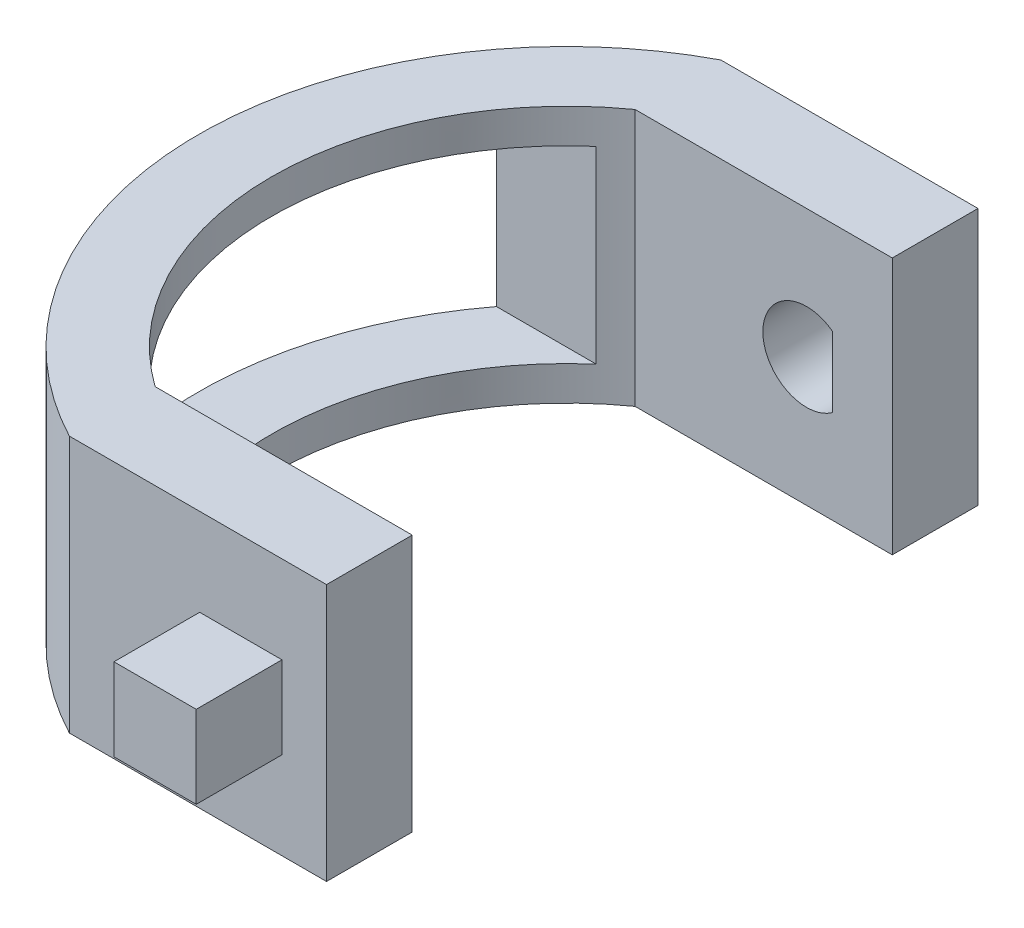
ISO-10303-21;
HEADER;
FILE_DESCRIPTION(('STEP AP214'),'2;1');
FILE_NAME('part.step','',(''),(''),'','','');
FILE_SCHEMA(('AUTOMOTIVE_DESIGN { 1 0 10303 214 1 1 1 1 }'));
ENDSEC;
DATA;
#1=APPLICATION_CONTEXT('core data for automotive mechanical design processes');
#2=APPLICATION_PROTOCOL_DEFINITION('international standard','automotive_design',2000,#1);
#3=PRODUCT_CONTEXT('',#1,'mechanical');
#4=PRODUCT('Part','Part','',(#3));
#5=PRODUCT_RELATED_PRODUCT_CATEGORY('part','',(#4));
#6=PRODUCT_DEFINITION_FORMATION('','',#4);
#7=PRODUCT_DEFINITION_CONTEXT('part definition',#1,'design');
#8=PRODUCT_DEFINITION('design','',#6,#7);
#9=PRODUCT_DEFINITION_SHAPE('','',#8);
#10=(LENGTH_UNIT() NAMED_UNIT(*) SI_UNIT(.MILLI.,.METRE.));
#11=(NAMED_UNIT(*) PLANE_ANGLE_UNIT() SI_UNIT($,.RADIAN.));
#12=(NAMED_UNIT(*) SI_UNIT($,.STERADIAN.) SOLID_ANGLE_UNIT());
#13=UNCERTAINTY_MEASURE_WITH_UNIT(LENGTH_MEASURE(1.E-05),#10,'distance_accuracy_value','');
#14=(GEOMETRIC_REPRESENTATION_CONTEXT(3) GLOBAL_UNCERTAINTY_ASSIGNED_CONTEXT((#13)) GLOBAL_UNIT_ASSIGNED_CONTEXT((#10,
#11,#12)) REPRESENTATION_CONTEXT('',''));
#15=CARTESIAN_POINT('',(0.,0.,0.));
#16=DIRECTION('',(0.,0.,1.));
#17=DIRECTION('',(1.,0.,0.));
#18=AXIS2_PLACEMENT_3D('',#15,#16,#17);
#19=CARTESIAN_POINT('',(2.4,-9.9,-19.));
#20=DIRECTION('',(0.,1.,0.));
#21=DIRECTION('',(0.,0.,1.));
#22=AXIS2_PLACEMENT_3D('',#19,#20,#21);
#23=CYLINDRICAL_SURFACE('',#22,21.4709105535839);
#24=CARTESIAN_POINT('',(2.4,5.1,-19.));
#25=DIRECTION('',(0.,-1.,0.));
#26=DIRECTION('',(0.,0.,-1.));
#27=AXIS2_PLACEMENT_3D('',#24,#25,#26);
#28=CIRCLE('',#27,21.4709105535839);
#29=CARTESIAN_POINT('',(-7.59999999999999,5.1,0.));
#30=VERTEX_POINT('',#29);
#31=CARTESIAN_POINT('',(-7.6,5.1,-38.));
#32=VERTEX_POINT('',#31);
#33=EDGE_CURVE('E260',#30,#32,#28,.T.);
#34=ORIENTED_EDGE('',*,*,#33,.T.);
#35=DIRECTION('',(0.,1.,0.));
#36=VECTOR('',#35,1.);
#37=CARTESIAN_POINT('',(-7.60000000000001,-9.9,-38.));
#38=LINE('',#37,#36);
#39=CARTESIAN_POINT('',(-7.6,-9.9,-38.));
#40=VERTEX_POINT('',#39);
#41=EDGE_CURVE('E268',#40,#32,#38,.T.);
#42=ORIENTED_EDGE('',*,*,#41,.F.);
#43=CARTESIAN_POINT('',(2.4,-9.9,-19.));
#44=DIRECTION('',(0.,-1.,0.));
#45=DIRECTION('',(0.,0.,-1.));
#46=AXIS2_PLACEMENT_3D('',#43,#44,#45);
#47=CIRCLE('',#46,21.4709105535839);
#48=CARTESIAN_POINT('',(-7.6,-9.9,0.));
#49=VERTEX_POINT('',#48);
#50=EDGE_CURVE('E259',#49,#40,#47,.T.);
#51=ORIENTED_EDGE('',*,*,#50,.F.);
#52=DIRECTION('',(0.,1.,0.));
#53=VECTOR('',#52,1.);
#54=CARTESIAN_POINT('',(-7.6,0.,0.));
#55=LINE('',#54,#53);
#56=EDGE_CURVE('E278',#49,#30,#55,.T.);
#57=ORIENTED_EDGE('',*,*,#56,.T.);
#58=EDGE_LOOP('',(#34,#42,#51,#57));
#59=FACE_BOUND('',#58,.T.);
#60=DIRECTION('',(0.,1.,0.));
#61=VECTOR('',#60,1.);
#62=CARTESIAN_POINT('',(-14.6880074906351,-9.9,-6.));
#63=LINE('',#62,#61);
#64=CARTESIAN_POINT('',(-14.6880074906351,3.1,-6.));
#65=VERTEX_POINT('',#64);
#66=CARTESIAN_POINT('',(-14.6880074906351,-7.9,-6.));
#67=VERTEX_POINT('',#66);
#68=EDGE_CURVE('E210',#65,#67,#63,.F.);
#69=ORIENTED_EDGE('',*,*,#68,.T.);
#70=CARTESIAN_POINT('',(2.4,-7.9,-19.));
#71=DIRECTION('',(0.,-1.,0.));
#72=DIRECTION('',(0.,0.,-1.));
#73=AXIS2_PLACEMENT_3D('',#70,#71,#72);
#74=CIRCLE('',#73,21.4709105535839);
#75=CARTESIAN_POINT('',(-14.6880074906351,-7.9,-32.));
#76=VERTEX_POINT('',#75);
#77=EDGE_CURVE('E190',#76,#67,#74,.F.);
#78=ORIENTED_EDGE('',*,*,#77,.F.);
#79=DIRECTION('',(0.,1.,0.));
#80=VECTOR('',#79,1.);
#81=CARTESIAN_POINT('',(-14.6880074906351,-9.9,-32.));
#82=LINE('',#81,#80);
#83=CARTESIAN_POINT('',(-14.6880074906351,3.1,-32.));
#84=VERTEX_POINT('',#83);
#85=EDGE_CURVE('E74',#84,#76,#82,.F.);
#86=ORIENTED_EDGE('',*,*,#85,.F.);
#87=CARTESIAN_POINT('',(2.4,3.1,-19.));
#88=DIRECTION('',(0.,-1.,0.));
#89=DIRECTION('',(0.,0.,-1.));
#90=AXIS2_PLACEMENT_3D('',#87,#88,#89);
#91=CIRCLE('',#90,21.4709105535839);
#92=EDGE_CURVE('E207',#84,#65,#91,.F.);
#93=ORIENTED_EDGE('',*,*,#92,.T.);
#94=EDGE_LOOP('',(#69,#78,#86,#93));
#95=FACE_BOUND('',#94,.T.);
#96=ADVANCED_FACE('F59',(#59,#95),#23,.T.);
#97=CARTESIAN_POINT('',(2.4,-9.9,-19.));
#98=DIRECTION('',(0.,1.,0.));
#99=DIRECTION('',(0.,0.,1.));
#100=AXIS2_PLACEMENT_3D('',#97,#98,#99);
#101=CYLINDRICAL_SURFACE('',#100,17.2046505340852);
#102=CARTESIAN_POINT('',(2.4,5.1,-19.));
#103=DIRECTION('',(0.,-1.,0.));
#104=DIRECTION('',(0.,0.,-1.));
#105=AXIS2_PLACEMENT_3D('',#102,#103,#104);
#106=CIRCLE('',#105,17.2046505340852);
#107=CARTESIAN_POINT('',(-7.6,5.1,-5.));
#108=VERTEX_POINT('',#107);
#109=CARTESIAN_POINT('',(-7.6,5.1,-33.));
#110=VERTEX_POINT('',#109);
#111=EDGE_CURVE('E255',#108,#110,#106,.T.);
#112=ORIENTED_EDGE('',*,*,#111,.F.);
#113=DIRECTION('',(0.,1.,0.));
#114=VECTOR('',#113,1.);
#115=CARTESIAN_POINT('',(-7.6,0.,-5.));
#116=LINE('',#115,#114);
#117=CARTESIAN_POINT('',(-7.6,-9.9,-5.));
#118=VERTEX_POINT('',#117);
#119=EDGE_CURVE('E283',#118,#108,#116,.T.);
#120=ORIENTED_EDGE('',*,*,#119,.F.);
#121=CARTESIAN_POINT('',(2.4,-9.9,-19.));
#122=DIRECTION('',(0.,-1.,0.));
#123=DIRECTION('',(0.,0.,-1.));
#124=AXIS2_PLACEMENT_3D('',#121,#122,#123);
#125=CIRCLE('',#124,17.2046505340852);
#126=CARTESIAN_POINT('',(-7.6,-9.9,-33.));
#127=VERTEX_POINT('',#126);
#128=EDGE_CURVE('E256',#118,#127,#125,.T.);
#129=ORIENTED_EDGE('',*,*,#128,.T.);
#130=DIRECTION('',(0.,1.,0.));
#131=VECTOR('',#130,1.);
#132=CARTESIAN_POINT('',(-7.6,-9.9,-33.));
#133=LINE('',#132,#131);
#134=EDGE_CURVE('E263',#127,#110,#133,.T.);
#135=ORIENTED_EDGE('',*,*,#134,.T.);
#136=EDGE_LOOP('',(#112,#120,#129,#135));
#137=FACE_BOUND('',#136,.T.);
#138=CARTESIAN_POINT('',(2.4,-7.9,-19.));
#139=DIRECTION('',(0.,-1.,0.));
#140=DIRECTION('',(0.,0.,-1.));
#141=AXIS2_PLACEMENT_3D('',#138,#139,#140);
#142=CIRCLE('',#141,17.2046505340852);
#143=CARTESIAN_POINT('',(-8.86942766958464,-7.9,-32.));
#144=VERTEX_POINT('',#143);
#145=CARTESIAN_POINT('',(-8.86942766958464,-7.9,-6.));
#146=VERTEX_POINT('',#145);
#147=EDGE_CURVE('E183',#144,#146,#142,.F.);
#148=ORIENTED_EDGE('',*,*,#147,.T.);
#149=DIRECTION('',(0.,1.,0.));
#150=VECTOR('',#149,1.);
#151=CARTESIAN_POINT('',(-8.86942766958464,-9.9,-6.));
#152=LINE('',#151,#150);
#153=CARTESIAN_POINT('',(-8.86942766958464,3.1,-6.));
#154=VERTEX_POINT('',#153);
#155=EDGE_CURVE('E202',#154,#146,#152,.F.);
#156=ORIENTED_EDGE('',*,*,#155,.F.);
#157=CARTESIAN_POINT('',(2.4,3.1,-19.));
#158=DIRECTION('',(0.,-1.,0.));
#159=DIRECTION('',(0.,0.,-1.));
#160=AXIS2_PLACEMENT_3D('',#157,#158,#159);
#161=CIRCLE('',#160,17.2046505340852);
#162=CARTESIAN_POINT('',(-8.86942766958464,3.1,-32.));
#163=VERTEX_POINT('',#162);
#164=EDGE_CURVE('E200',#163,#154,#161,.F.);
#165=ORIENTED_EDGE('',*,*,#164,.F.);
#166=DIRECTION('',(0.,1.,0.));
#167=VECTOR('',#166,1.);
#168=CARTESIAN_POINT('',(-8.86942766958464,-9.9,-32.));
#169=LINE('',#168,#167);
#170=EDGE_CURVE('E194',#163,#144,#169,.F.);
#171=ORIENTED_EDGE('',*,*,#170,.T.);
#172=EDGE_LOOP('',(#148,#156,#165,#171));
#173=FACE_BOUND('',#172,.T.);
#174=ADVANCED_FACE('F199',(#137,#173),#101,.F.);
#175=CARTESIAN_POINT('',(4.8,0.,5.));
#176=DIRECTION('',(1.,0.,0.));
#177=DIRECTION('',(0.,1.,0.));
#178=AXIS2_PLACEMENT_3D('',#175,#176,#177);
#179=PLANE('',#178);
#180=DIRECTION('',(0.,-1.,0.));
#181=VECTOR('',#180,1.);
#182=CARTESIAN_POINT('',(4.8,0.,0.));
#183=LINE('',#182,#181);
#184=CARTESIAN_POINT('',(4.8,0.,0.));
#185=VERTEX_POINT('',#184);
#186=CARTESIAN_POINT('',(4.8,-4.8,0.));
#187=VERTEX_POINT('',#186);
#188=EDGE_CURVE('E298',#185,#187,#183,.T.);
#189=ORIENTED_EDGE('',*,*,#188,.F.);
#190=DIRECTION('',(0.,0.,-1.));
#191=VECTOR('',#190,1.);
#192=CARTESIAN_POINT('',(4.8,0.,5.));
#193=LINE('',#192,#191);
#194=CARTESIAN_POINT('',(4.8,0.,5.));
#195=VERTEX_POINT('',#194);
#196=EDGE_CURVE('E12',#195,#185,#193,.T.);
#197=ORIENTED_EDGE('',*,*,#196,.F.);
#198=DIRECTION('',(0.,-1.,0.));
#199=VECTOR('',#198,1.);
#200=CARTESIAN_POINT('',(4.8,0.,5.));
#201=LINE('',#200,#199);
#202=CARTESIAN_POINT('',(4.8,-4.8,5.));
#203=VERTEX_POINT('',#202);
#204=EDGE_CURVE('E300',#195,#203,#201,.T.);
#205=ORIENTED_EDGE('',*,*,#204,.T.);
#206=DIRECTION('',(0.,0.,-1.));
#207=VECTOR('',#206,1.);
#208=CARTESIAN_POINT('',(4.8,-4.8,5.));
#209=LINE('',#208,#207);
#210=EDGE_CURVE('E311',#203,#187,#209,.T.);
#211=ORIENTED_EDGE('',*,*,#210,.T.);
#212=EDGE_LOOP('',(#189,#197,#205,#211));
#213=FACE_BOUND('',#212,.T.);
#214=ADVANCED_FACE('F61',(#213),#179,.T.);
#215=CARTESIAN_POINT('',(0.,0.,5.));
#216=DIRECTION('',(0.,1.,0.));
#217=DIRECTION('',(0.,0.,1.));
#218=AXIS2_PLACEMENT_3D('',#215,#216,#217);
#219=PLANE('',#218);
#220=DIRECTION('',(1.,0.,0.));
#221=VECTOR('',#220,1.);
#222=CARTESIAN_POINT('',(0.,0.,0.));
#223=LINE('',#222,#221);
#224=CARTESIAN_POINT('',(0.,0.,0.));
#225=VERTEX_POINT('',#224);
#226=EDGE_CURVE('E313',#225,#185,#223,.T.);
#227=ORIENTED_EDGE('',*,*,#226,.F.);
#228=DIRECTION('',(0.,0.,-1.));
#229=VECTOR('',#228,1.);
#230=CARTESIAN_POINT('',(0.,0.,5.));
#231=LINE('',#230,#229);
#232=CARTESIAN_POINT('',(0.,0.,5.));
#233=VERTEX_POINT('',#232);
#234=EDGE_CURVE('E67',#233,#225,#231,.T.);
#235=ORIENTED_EDGE('',*,*,#234,.F.);
#236=DIRECTION('',(1.,0.,0.));
#237=VECTOR('',#236,1.);
#238=CARTESIAN_POINT('',(0.,0.,5.));
#239=LINE('',#238,#237);
#240=EDGE_CURVE('E303',#233,#195,#239,.T.);
#241=ORIENTED_EDGE('',*,*,#240,.T.);
#242=ORIENTED_EDGE('',*,*,#196,.T.);
#243=EDGE_LOOP('',(#227,#235,#241,#242));
#244=FACE_BOUND('',#243,.T.);
#245=ADVANCED_FACE('F332',(#244),#219,.T.);
#246=CARTESIAN_POINT('',(0.,0.,5.));
#247=DIRECTION('',(1.,0.,0.));
#248=DIRECTION('',(0.,1.,0.));
#249=AXIS2_PLACEMENT_3D('',#246,#247,#248);
#250=PLANE('',#249);
#251=DIRECTION('',(0.,-1.,0.));
#252=VECTOR('',#251,1.);
#253=CARTESIAN_POINT('',(0.,0.,0.));
#254=LINE('',#253,#252);
#255=CARTESIAN_POINT('',(0.,-4.8,0.));
#256=VERTEX_POINT('',#255);
#257=EDGE_CURVE('E315',#225,#256,#254,.T.);
#258=ORIENTED_EDGE('',*,*,#257,.T.);
#259=DIRECTION('',(0.,0.,-1.));
#260=VECTOR('',#259,1.);
#261=CARTESIAN_POINT('',(0.,-4.8,5.));
#262=LINE('',#261,#260);
#263=CARTESIAN_POINT('',(0.,-4.8,5.));
#264=VERTEX_POINT('',#263);
#265=EDGE_CURVE('E322',#264,#256,#262,.T.);
#266=ORIENTED_EDGE('',*,*,#265,.F.);
#267=DIRECTION('',(0.,-1.,0.));
#268=VECTOR('',#267,1.);
#269=CARTESIAN_POINT('',(0.,0.,5.));
#270=LINE('',#269,#268);
#271=EDGE_CURVE('E307',#233,#264,#270,.T.);
#272=ORIENTED_EDGE('',*,*,#271,.F.);
#273=ORIENTED_EDGE('',*,*,#234,.T.);
#274=EDGE_LOOP('',(#258,#266,#272,#273));
#275=FACE_BOUND('',#274,.T.);
#276=ADVANCED_FACE('F328',(#275),#250,.F.);
#277=CARTESIAN_POINT('',(0.,-4.8,5.));
#278=DIRECTION('',(0.,1.,0.));
#279=DIRECTION('',(-1.,0.,0.));
#280=AXIS2_PLACEMENT_3D('',#277,#278,#279);
#281=PLANE('',#280);
#282=DIRECTION('',(1.,0.,0.));
#283=VECTOR('',#282,1.);
#284=CARTESIAN_POINT('',(0.,-4.8,0.));
#285=LINE('',#284,#283);
#286=EDGE_CURVE('E304',#256,#187,#285,.T.);
#287=ORIENTED_EDGE('',*,*,#286,.T.);
#288=ORIENTED_EDGE('',*,*,#210,.F.);
#289=DIRECTION('',(1.,0.,0.));
#290=VECTOR('',#289,1.);
#291=CARTESIAN_POINT('',(0.,-4.8,5.));
#292=LINE('',#291,#290);
#293=EDGE_CURVE('E309',#264,#203,#292,.T.);
#294=ORIENTED_EDGE('',*,*,#293,.F.);
#295=ORIENTED_EDGE('',*,*,#265,.T.);
#296=EDGE_LOOP('',(#287,#288,#294,#295));
#297=FACE_BOUND('',#296,.T.);
#298=ADVANCED_FACE('F339',(#297),#281,.F.);
#299=CARTESIAN_POINT('',(0.,0.,5.));
#300=DIRECTION('',(0.,0.,1.));
#301=DIRECTION('',(1.,0.,0.));
#302=AXIS2_PLACEMENT_3D('',#299,#300,#301);
#303=PLANE('',#302);
#304=ORIENTED_EDGE('',*,*,#204,.F.);
#305=ORIENTED_EDGE('',*,*,#240,.F.);
#306=ORIENTED_EDGE('',*,*,#271,.T.);
#307=ORIENTED_EDGE('',*,*,#293,.T.);
#308=EDGE_LOOP('',(#304,#305,#306,#307));
#309=FACE_BOUND('',#308,.T.);
#310=ADVANCED_FACE('F343',(#309),#303,.T.);
#311=CARTESIAN_POINT('',(0.,-9.9,-5.));
#312=DIRECTION('',(0.,-1.,0.));
#313=DIRECTION('',(0.,0.,-1.));
#314=AXIS2_PLACEMENT_3D('',#311,#312,#313);
#315=PLANE('',#314);
#316=DIRECTION('',(1.,0.,0.));
#317=VECTOR('',#316,1.);
#318=CARTESIAN_POINT('',(0.,-9.9,0.));
#319=LINE('',#318,#317);
#320=CARTESIAN_POINT('',(7.4,-9.9,0.));
#321=VERTEX_POINT('',#320);
#322=EDGE_CURVE('E271',#49,#321,#319,.T.);
#323=ORIENTED_EDGE('',*,*,#322,.F.);
#324=ORIENTED_EDGE('',*,*,#50,.T.);
#325=DIRECTION('',(1.,0.,0.));
#326=VECTOR('',#325,1.);
#327=CARTESIAN_POINT('',(0.,-9.9,-38.));
#328=LINE('',#327,#326);
#329=CARTESIAN_POINT('',(7.4,-9.9,-38.));
#330=VERTEX_POINT('',#329);
#331=EDGE_CURVE('E233',#40,#330,#328,.T.);
#332=ORIENTED_EDGE('',*,*,#331,.T.);
#333=DIRECTION('',(0.,0.,-1.));
#334=VECTOR('',#333,1.);
#335=CARTESIAN_POINT('',(7.4,-9.9,-33.));
#336=LINE('',#335,#334);
#337=CARTESIAN_POINT('',(7.4,-9.9,-33.));
#338=VERTEX_POINT('',#337);
#339=EDGE_CURVE('E252',#338,#330,#336,.T.);
#340=ORIENTED_EDGE('',*,*,#339,.F.);
#341=DIRECTION('',(1.,0.,0.));
#342=VECTOR('',#341,1.);
#343=CARTESIAN_POINT('',(0.,-9.9,-33.));
#344=LINE('',#343,#342);
#345=EDGE_CURVE('E234',#127,#338,#344,.T.);
#346=ORIENTED_EDGE('',*,*,#345,.F.);
#347=ORIENTED_EDGE('',*,*,#128,.F.);
#348=DIRECTION('',(1.,0.,0.));
#349=VECTOR('',#348,1.);
#350=CARTESIAN_POINT('',(0.,-9.9,-5.));
#351=LINE('',#350,#349);
#352=CARTESIAN_POINT('',(7.4,-9.9,-5.));
#353=VERTEX_POINT('',#352);
#354=EDGE_CURVE('E274',#118,#353,#351,.T.);
#355=ORIENTED_EDGE('',*,*,#354,.T.);
#356=DIRECTION('',(0.,0.,1.));
#357=VECTOR('',#356,1.);
#358=CARTESIAN_POINT('',(7.4,-9.9,-5.));
#359=LINE('',#358,#357);
#360=EDGE_CURVE('E285',#353,#321,#359,.T.);
#361=ORIENTED_EDGE('',*,*,#360,.T.);
#362=EDGE_LOOP('',(#323,#324,#332,#340,#346,#347,#355,#361));
#363=FACE_BOUND('',#362,.T.);
#364=ADVANCED_FACE('F372',(#363),#315,.T.);
#365=CARTESIAN_POINT('',(0.,5.1,-5.));
#366=DIRECTION('',(0.,-1.,0.));
#367=DIRECTION('',(0.,0.,-1.));
#368=AXIS2_PLACEMENT_3D('',#365,#366,#367);
#369=PLANE('',#368);
#370=DIRECTION('',(1.,0.,0.));
#371=VECTOR('',#370,1.);
#372=CARTESIAN_POINT('',(0.,5.1,0.));
#373=LINE('',#372,#371);
#374=CARTESIAN_POINT('',(7.4,5.1,0.));
#375=VERTEX_POINT('',#374);
#376=EDGE_CURVE('E291',#30,#375,#373,.T.);
#377=ORIENTED_EDGE('',*,*,#376,.T.);
#378=DIRECTION('',(0.,0.,1.));
#379=VECTOR('',#378,1.);
#380=CARTESIAN_POINT('',(7.4,5.1,-5.));
#381=LINE('',#380,#379);
#382=CARTESIAN_POINT('',(7.4,5.1,-5.));
#383=VERTEX_POINT('',#382);
#384=EDGE_CURVE('E296',#383,#375,#381,.T.);
#385=ORIENTED_EDGE('',*,*,#384,.F.);
#386=DIRECTION('',(1.,0.,0.));
#387=VECTOR('',#386,1.);
#388=CARTESIAN_POINT('',(0.,5.1,-5.));
#389=LINE('',#388,#387);
#390=EDGE_CURVE('E281',#108,#383,#389,.T.);
#391=ORIENTED_EDGE('',*,*,#390,.F.);
#392=ORIENTED_EDGE('',*,*,#111,.T.);
#393=DIRECTION('',(1.,0.,0.));
#394=VECTOR('',#393,1.);
#395=CARTESIAN_POINT('',(0.,5.1,-33.));
#396=LINE('',#395,#394);
#397=CARTESIAN_POINT('',(7.4,5.1,-33.));
#398=VERTEX_POINT('',#397);
#399=EDGE_CURVE('E240',#110,#398,#396,.T.);
#400=ORIENTED_EDGE('',*,*,#399,.T.);
#401=DIRECTION('',(0.,0.,-1.));
#402=VECTOR('',#401,1.);
#403=CARTESIAN_POINT('',(7.4,5.1,-33.));
#404=LINE('',#403,#402);
#405=CARTESIAN_POINT('',(7.4,5.1,-38.));
#406=VERTEX_POINT('',#405);
#407=EDGE_CURVE('E243',#398,#406,#404,.T.);
#408=ORIENTED_EDGE('',*,*,#407,.T.);
#409=DIRECTION('',(1.,0.,0.));
#410=VECTOR('',#409,1.);
#411=CARTESIAN_POINT('',(0.,5.1,-38.));
#412=LINE('',#411,#410);
#413=EDGE_CURVE('E238',#32,#406,#412,.T.);
#414=ORIENTED_EDGE('',*,*,#413,.F.);
#415=ORIENTED_EDGE('',*,*,#33,.F.);
#416=EDGE_LOOP('',(#377,#385,#391,#392,#400,#408,#414,#415));
#417=FACE_BOUND('',#416,.T.);
#418=ADVANCED_FACE('F369',(#417),#369,.F.);
#419=CARTESIAN_POINT('',(7.4,0.,-5.));
#420=DIRECTION('',(1.,0.,0.));
#421=DIRECTION('',(0.,0.,-1.));
#422=AXIS2_PLACEMENT_3D('',#419,#420,#421);
#423=PLANE('',#422);
#424=DIRECTION('',(0.,1.,0.));
#425=VECTOR('',#424,1.);
#426=CARTESIAN_POINT('',(7.4,0.,0.));
#427=LINE('',#426,#425);
#428=EDGE_CURVE('E288',#321,#375,#427,.T.);
#429=ORIENTED_EDGE('',*,*,#428,.F.);
#430=ORIENTED_EDGE('',*,*,#360,.F.);
#431=DIRECTION('',(0.,1.,0.));
#432=VECTOR('',#431,1.);
#433=CARTESIAN_POINT('',(7.4,0.,-5.));
#434=LINE('',#433,#432);
#435=EDGE_CURVE('E277',#353,#383,#434,.T.);
#436=ORIENTED_EDGE('',*,*,#435,.T.);
#437=ORIENTED_EDGE('',*,*,#384,.T.);
#438=EDGE_LOOP('',(#429,#430,#436,#437));
#439=FACE_BOUND('',#438,.T.);
#440=ADVANCED_FACE('F365',(#439),#423,.T.);
#441=CARTESIAN_POINT('',(0.,0.,-5.));
#442=DIRECTION('',(0.,0.,1.));
#443=DIRECTION('',(1.,0.,0.));
#444=AXIS2_PLACEMENT_3D('',#441,#442,#443);
#445=PLANE('',#444);
#446=ORIENTED_EDGE('',*,*,#354,.F.);
#447=ORIENTED_EDGE('',*,*,#119,.T.);
#448=ORIENTED_EDGE('',*,*,#390,.T.);
#449=ORIENTED_EDGE('',*,*,#435,.F.);
#450=EDGE_LOOP('',(#446,#447,#448,#449));
#451=FACE_BOUND('',#450,.T.);
#452=ADVANCED_FACE('F362',(#451),#445,.F.);
#453=CARTESIAN_POINT('',(0.,0.,0.));
#454=DIRECTION('',(0.,0.,1.));
#455=DIRECTION('',(1.,0.,0.));
#456=AXIS2_PLACEMENT_3D('',#453,#454,#455);
#457=PLANE('',#456);
#458=ORIENTED_EDGE('',*,*,#226,.T.);
#459=ORIENTED_EDGE('',*,*,#188,.T.);
#460=ORIENTED_EDGE('',*,*,#286,.F.);
#461=ORIENTED_EDGE('',*,*,#257,.F.);
#462=EDGE_LOOP('',(#458,#459,#460,#461));
#463=FACE_BOUND('',#462,.T.);
#464=ORIENTED_EDGE('',*,*,#322,.T.);
#465=ORIENTED_EDGE('',*,*,#428,.T.);
#466=ORIENTED_EDGE('',*,*,#376,.F.);
#467=ORIENTED_EDGE('',*,*,#56,.F.);
#468=EDGE_LOOP('',(#464,#465,#466,#467));
#469=FACE_BOUND('',#468,.T.);
#470=ADVANCED_FACE('F335',(#463,#469),#457,.T.);
#471=CARTESIAN_POINT('',(7.4,0.,-33.));
#472=DIRECTION('',(-1.,0.,0.));
#473=DIRECTION('',(0.,0.,1.));
#474=AXIS2_PLACEMENT_3D('',#471,#472,#473);
#475=PLANE('',#474);
#476=DIRECTION('',(0.,1.,0.));
#477=VECTOR('',#476,1.);
#478=CARTESIAN_POINT('',(7.4,0.,-38.));
#479=LINE('',#478,#477);
#480=EDGE_CURVE('E246',#330,#406,#479,.T.);
#481=ORIENTED_EDGE('',*,*,#480,.T.);
#482=ORIENTED_EDGE('',*,*,#407,.F.);
#483=DIRECTION('',(0.,1.,0.));
#484=VECTOR('',#483,1.);
#485=CARTESIAN_POINT('',(7.4,0.,-33.));
#486=LINE('',#485,#484);
#487=EDGE_CURVE('E237',#338,#398,#486,.T.);
#488=ORIENTED_EDGE('',*,*,#487,.F.);
#489=ORIENTED_EDGE('',*,*,#339,.T.);
#490=EDGE_LOOP('',(#481,#482,#488,#489));
#491=FACE_BOUND('',#490,.T.);
#492=ADVANCED_FACE('F359',(#491),#475,.F.);
#493=CARTESIAN_POINT('',(0.,0.,-38.));
#494=DIRECTION('',(0.,0.,1.));
#495=DIRECTION('',(1.,0.,0.));
#496=AXIS2_PLACEMENT_3D('',#493,#494,#495);
#497=PLANE('',#496);
#498=DIRECTION('',(0.,1.,0.));
#499=VECTOR('',#498,1.);
#500=CARTESIAN_POINT('',(3.9,0.,-38.));
#501=LINE('',#500,#499);
#502=CARTESIAN_POINT('',(3.9,-4.46215906273013,-38.));
#503=VERTEX_POINT('',#502);
#504=CARTESIAN_POINT('',(3.9,-0.337840937269872,-38.));
#505=VERTEX_POINT('',#504);
#506=EDGE_CURVE('E220',#503,#505,#501,.T.);
#507=ORIENTED_EDGE('',*,*,#506,.T.);
#508=CARTESIAN_POINT('',(2.4,-2.4,-38.));
#509=DIRECTION('',(0.,0.,-1.));
#510=DIRECTION('',(-1.,0.,0.));
#511=AXIS2_PLACEMENT_3D('',#508,#509,#510);
#512=CIRCLE('',#511,2.55);
#513=EDGE_CURVE('E223',#503,#505,#512,.T.);
#514=ORIENTED_EDGE('',*,*,#513,.F.);
#515=EDGE_LOOP('',(#507,#514));
#516=FACE_BOUND('',#515,.T.);
#517=ORIENTED_EDGE('',*,*,#331,.F.);
#518=ORIENTED_EDGE('',*,*,#41,.T.);
#519=ORIENTED_EDGE('',*,*,#413,.T.);
#520=ORIENTED_EDGE('',*,*,#480,.F.);
#521=EDGE_LOOP('',(#517,#518,#519,#520));
#522=FACE_BOUND('',#521,.T.);
#523=ADVANCED_FACE('F423',(#516,#522),#497,.F.);
#524=CARTESIAN_POINT('',(0.,0.,-33.));
#525=DIRECTION('',(0.,0.,1.));
#526=DIRECTION('',(1.,0.,0.));
#527=AXIS2_PLACEMENT_3D('',#524,#525,#526);
#528=PLANE('',#527);
#529=CARTESIAN_POINT('',(2.4,-2.4,-33.));
#530=DIRECTION('',(0.,0.,1.));
#531=DIRECTION('',(1.,0.,0.));
#532=AXIS2_PLACEMENT_3D('',#529,#530,#531);
#533=CIRCLE('',#532,2.55);
#534=CARTESIAN_POINT('',(3.9,-4.46215906273013,-33.));
#535=VERTEX_POINT('',#534);
#536=CARTESIAN_POINT('',(3.9,-0.337840937269872,-33.));
#537=VERTEX_POINT('',#536);
#538=EDGE_CURVE('E229',#535,#537,#533,.F.);
#539=ORIENTED_EDGE('',*,*,#538,.T.);
#540=DIRECTION('',(0.,1.,0.));
#541=VECTOR('',#540,1.);
#542=CARTESIAN_POINT('',(3.9,0.,-33.));
#543=LINE('',#542,#541);
#544=EDGE_CURVE('E218',#535,#537,#543,.T.);
#545=ORIENTED_EDGE('',*,*,#544,.F.);
#546=EDGE_LOOP('',(#539,#545));
#547=FACE_BOUND('',#546,.T.);
#548=ORIENTED_EDGE('',*,*,#345,.T.);
#549=ORIENTED_EDGE('',*,*,#487,.T.);
#550=ORIENTED_EDGE('',*,*,#399,.F.);
#551=ORIENTED_EDGE('',*,*,#134,.F.);
#552=EDGE_LOOP('',(#548,#549,#550,#551));
#553=FACE_BOUND('',#552,.T.);
#554=ADVANCED_FACE('F430',(#547,#553),#528,.T.);
#555=CARTESIAN_POINT('',(2.4,-2.4,5.001));
#556=DIRECTION('',(0.,0.,-1.));
#557=DIRECTION('',(-1.,0.,0.));
#558=AXIS2_PLACEMENT_3D('',#555,#556,#557);
#559=CYLINDRICAL_SURFACE('',#558,2.55);
#560=DIRECTION('',(0.,0.,-1.));
#561=VECTOR('',#560,1.);
#562=CARTESIAN_POINT('',(3.9,-4.46215906273013,5.001));
#563=LINE('',#562,#561);
#564=EDGE_CURVE('E225',#535,#503,#563,.T.);
#565=ORIENTED_EDGE('',*,*,#564,.T.);
#566=ORIENTED_EDGE('',*,*,#513,.T.);
#567=DIRECTION('',(0.,0.,-1.));
#568=VECTOR('',#567,1.);
#569=CARTESIAN_POINT('',(3.9,-0.337840937269872,5.001));
#570=LINE('',#569,#568);
#571=EDGE_CURVE('E226',#537,#505,#570,.T.);
#572=ORIENTED_EDGE('',*,*,#571,.F.);
#573=ORIENTED_EDGE('',*,*,#538,.F.);
#574=EDGE_LOOP('',(#565,#566,#572,#573));
#575=FACE_BOUND('',#574,.T.);
#576=ADVANCED_FACE('F437',(#575),#559,.F.);
#577=CARTESIAN_POINT('',(3.9,0.,5.001));
#578=DIRECTION('',(-1.,0.,0.));
#579=DIRECTION('',(0.,0.,1.));
#580=AXIS2_PLACEMENT_3D('',#577,#578,#579);
#581=PLANE('',#580);
#582=ORIENTED_EDGE('',*,*,#544,.T.);
#583=ORIENTED_EDGE('',*,*,#571,.T.);
#584=ORIENTED_EDGE('',*,*,#506,.F.);
#585=ORIENTED_EDGE('',*,*,#564,.F.);
#586=EDGE_LOOP('',(#582,#583,#584,#585));
#587=FACE_BOUND('',#586,.T.);
#588=ADVANCED_FACE('F445',(#587),#581,.T.);
#589=CARTESIAN_POINT('',(-19.0719105535839,-7.9,-6.));
#590=DIRECTION('',(0.,0.,-1.));
#591=DIRECTION('',(-1.,0.,0.));
#592=AXIS2_PLACEMENT_3D('',#589,#590,#591);
#593=PLANE('',#592);
#594=DIRECTION('',(1.,0.,0.));
#595=VECTOR('',#594,1.);
#596=CARTESIAN_POINT('',(-19.0719105535839,3.1,-6.));
#597=LINE('',#596,#595);
#598=EDGE_CURVE('E191',#65,#154,#597,.T.);
#599=ORIENTED_EDGE('',*,*,#598,.T.);
#600=ORIENTED_EDGE('',*,*,#155,.T.);
#601=DIRECTION('',(1.,0.,0.));
#602=VECTOR('',#601,1.);
#603=CARTESIAN_POINT('',(-19.0719105535839,-7.9,-6.));
#604=LINE('',#603,#602);
#605=EDGE_CURVE('E82',#67,#146,#604,.T.);
#606=ORIENTED_EDGE('',*,*,#605,.F.);
#607=ORIENTED_EDGE('',*,*,#68,.F.);
#608=EDGE_LOOP('',(#599,#600,#606,#607));
#609=FACE_BOUND('',#608,.T.);
#610=ADVANCED_FACE('F453',(#609),#593,.T.);
#611=CARTESIAN_POINT('',(-19.0719105535839,3.1,-6.));
#612=DIRECTION('',(0.,-1.,0.));
#613=DIRECTION('',(0.,0.,-1.));
#614=AXIS2_PLACEMENT_3D('',#611,#612,#613);
#615=PLANE('',#614);
#616=DIRECTION('',(1.,0.,0.));
#617=VECTOR('',#616,1.);
#618=CARTESIAN_POINT('',(-19.0719105535839,3.1,-32.));
#619=LINE('',#618,#617);
#620=EDGE_CURVE('E196',#84,#163,#619,.T.);
#621=ORIENTED_EDGE('',*,*,#620,.T.);
#622=ORIENTED_EDGE('',*,*,#164,.T.);
#623=ORIENTED_EDGE('',*,*,#598,.F.);
#624=ORIENTED_EDGE('',*,*,#92,.F.);
#625=EDGE_LOOP('',(#621,#622,#623,#624));
#626=FACE_BOUND('',#625,.T.);
#627=ADVANCED_FACE('F461',(#626),#615,.T.);
#628=CARTESIAN_POINT('',(-19.0719105535839,-7.9,-32.));
#629=DIRECTION('',(0.,0.,-1.));
#630=DIRECTION('',(-1.,0.,0.));
#631=AXIS2_PLACEMENT_3D('',#628,#629,#630);
#632=PLANE('',#631);
#633=ORIENTED_EDGE('',*,*,#85,.T.);
#634=DIRECTION('',(1.,0.,0.));
#635=VECTOR('',#634,1.);
#636=CARTESIAN_POINT('',(-19.0719105535839,-7.9,-32.));
#637=LINE('',#636,#635);
#638=EDGE_CURVE('E185',#76,#144,#637,.T.);
#639=ORIENTED_EDGE('',*,*,#638,.T.);
#640=ORIENTED_EDGE('',*,*,#170,.F.);
#641=ORIENTED_EDGE('',*,*,#620,.F.);
#642=EDGE_LOOP('',(#633,#639,#640,#641));
#643=FACE_BOUND('',#642,.T.);
#644=ADVANCED_FACE('F193',(#643),#632,.F.);
#645=CARTESIAN_POINT('',(-19.0719105535839,-7.9,-6.));
#646=DIRECTION('',(0.,-1.,0.));
#647=DIRECTION('',(0.,0.,-1.));
#648=AXIS2_PLACEMENT_3D('',#645,#646,#647);
#649=PLANE('',#648);
#650=ORIENTED_EDGE('',*,*,#77,.T.);
#651=ORIENTED_EDGE('',*,*,#605,.T.);
#652=ORIENTED_EDGE('',*,*,#147,.F.);
#653=ORIENTED_EDGE('',*,*,#638,.F.);
#654=EDGE_LOOP('',(#650,#651,#652,#653));
#655=FACE_BOUND('',#654,.T.);
#656=ADVANCED_FACE('F184',(#655),#649,.F.);
#657=CLOSED_SHELL('',(#96,#174,#214,#245,#276,#298,#310,#364,#418,#440,#452,#470,#492,#523,#554,
#576,#588,#610,#627,#644,#656));
#658=MANIFOLD_SOLID_BREP('B2',#657);
#659=ADVANCED_BREP_SHAPE_REPRESENTATION('',(#18,#658),#14);
#660=SHAPE_DEFINITION_REPRESENTATION(#9,#659);
ENDSEC;
END-ISO-10303-21;
